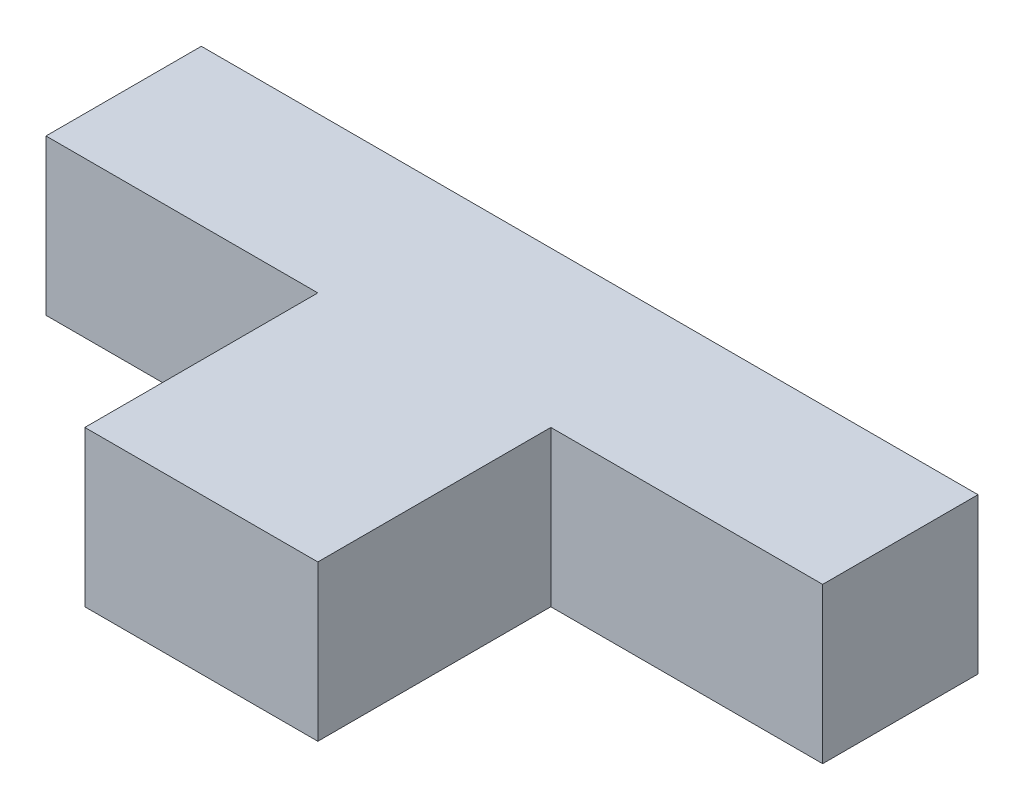
ISO-10303-21;
HEADER;
FILE_DESCRIPTION(('STEP AP214'),'2;1');
FILE_NAME('part.step','',(''),(''),'','','');
FILE_SCHEMA(('AUTOMOTIVE_DESIGN { 1 0 10303 214 1 1 1 1 }'));
ENDSEC;
DATA;
#1=APPLICATION_CONTEXT('core data for automotive mechanical design processes');
#2=APPLICATION_PROTOCOL_DEFINITION('international standard','automotive_design',2000,#1);
#3=PRODUCT_CONTEXT('',#1,'mechanical');
#4=PRODUCT('Part','Part','',(#3));
#5=PRODUCT_RELATED_PRODUCT_CATEGORY('part','',(#4));
#6=PRODUCT_DEFINITION_FORMATION('','',#4);
#7=PRODUCT_DEFINITION_CONTEXT('part definition',#1,'design');
#8=PRODUCT_DEFINITION('design','',#6,#7);
#9=PRODUCT_DEFINITION_SHAPE('','',#8);
#10=(LENGTH_UNIT() NAMED_UNIT(*) SI_UNIT(.MILLI.,.METRE.));
#11=(NAMED_UNIT(*) PLANE_ANGLE_UNIT() SI_UNIT($,.RADIAN.));
#12=(NAMED_UNIT(*) SI_UNIT($,.STERADIAN.) SOLID_ANGLE_UNIT());
#13=UNCERTAINTY_MEASURE_WITH_UNIT(LENGTH_MEASURE(1.E-05),#10,'distance_accuracy_value','');
#14=(GEOMETRIC_REPRESENTATION_CONTEXT(3) GLOBAL_UNCERTAINTY_ASSIGNED_CONTEXT((#13)) GLOBAL_UNIT_ASSIGNED_CONTEXT((#10,
#11,#12)) REPRESENTATION_CONTEXT('',''));
#15=CARTESIAN_POINT('',(0.,0.,0.));
#16=DIRECTION('',(0.,0.,1.));
#17=DIRECTION('',(1.,0.,0.));
#18=AXIS2_PLACEMENT_3D('',#15,#16,#17);
#19=CARTESIAN_POINT('',(0.,50.8,-25.4));
#20=DIRECTION('',(0.,0.,-1.));
#21=DIRECTION('',(-1.,0.,0.));
#22=AXIS2_PLACEMENT_3D('',#19,#20,#21);
#23=PLANE('',#22);
#24=DIRECTION('',(1.,0.,0.));
#25=VECTOR('',#24,1.);
#26=CARTESIAN_POINT('',(0.,0.,-25.4));
#27=LINE('',#26,#25);
#28=CARTESIAN_POINT('',(-127.,0.,-25.4));
#29=VERTEX_POINT('',#28);
#30=CARTESIAN_POINT('',(-38.1,0.,-25.4));
#31=VERTEX_POINT('',#30);
#32=EDGE_CURVE('E129',#29,#31,#27,.T.);
#33=ORIENTED_EDGE('',*,*,#32,.T.);
#34=DIRECTION('',(0.,-1.,0.));
#35=VECTOR('',#34,1.);
#36=CARTESIAN_POINT('',(-38.1,50.8,-25.4));
#37=LINE('',#36,#35);
#38=CARTESIAN_POINT('',(-38.1,50.8,-25.4));
#39=VERTEX_POINT('',#38);
#40=EDGE_CURVE('E11',#39,#31,#37,.T.);
#41=ORIENTED_EDGE('',*,*,#40,.F.);
#42=DIRECTION('',(1.,0.,0.));
#43=VECTOR('',#42,1.);
#44=CARTESIAN_POINT('',(0.,50.8,-25.4));
#45=LINE('',#44,#43);
#46=CARTESIAN_POINT('',(-127.,50.8,-25.4));
#47=VERTEX_POINT('',#46);
#48=EDGE_CURVE('E87',#47,#39,#45,.T.);
#49=ORIENTED_EDGE('',*,*,#48,.F.);
#50=DIRECTION('',(0.,-1.,0.));
#51=VECTOR('',#50,1.);
#52=CARTESIAN_POINT('',(-127.,50.8,-25.4));
#53=LINE('',#52,#51);
#54=EDGE_CURVE('E50',#47,#29,#53,.T.);
#55=ORIENTED_EDGE('',*,*,#54,.T.);
#56=EDGE_LOOP('',(#33,#41,#49,#55));
#57=FACE_BOUND('',#56,.T.);
#58=ADVANCED_FACE('F33',(#57),#23,.F.);
#59=CARTESIAN_POINT('',(-38.1,50.8,0.));
#60=DIRECTION('',(-1.,0.,0.));
#61=DIRECTION('',(0.,0.,1.));
#62=AXIS2_PLACEMENT_3D('',#59,#60,#61);
#63=PLANE('',#62);
#64=DIRECTION('',(0.,0.,-1.));
#65=VECTOR('',#64,1.);
#66=CARTESIAN_POINT('',(-38.1,0.,0.));
#67=LINE('',#66,#65);
#68=CARTESIAN_POINT('',(-38.1,0.,50.8));
#69=VERTEX_POINT('',#68);
#70=EDGE_CURVE('E131',#69,#31,#67,.T.);
#71=ORIENTED_EDGE('',*,*,#70,.F.);
#72=DIRECTION('',(0.,-1.,0.));
#73=VECTOR('',#72,1.);
#74=CARTESIAN_POINT('',(-38.1,50.8,50.8));
#75=LINE('',#74,#73);
#76=CARTESIAN_POINT('',(-38.1,50.8,50.8));
#77=VERTEX_POINT('',#76);
#78=EDGE_CURVE('E42',#77,#69,#75,.T.);
#79=ORIENTED_EDGE('',*,*,#78,.F.);
#80=DIRECTION('',(0.,0.,-1.));
#81=VECTOR('',#80,1.);
#82=CARTESIAN_POINT('',(-38.1,50.8,0.));
#83=LINE('',#82,#81);
#84=EDGE_CURVE('E175',#77,#39,#83,.T.);
#85=ORIENTED_EDGE('',*,*,#84,.T.);
#86=ORIENTED_EDGE('',*,*,#40,.T.);
#87=EDGE_LOOP('',(#71,#79,#85,#86));
#88=FACE_BOUND('',#87,.T.);
#89=ADVANCED_FACE('F35',(#88),#63,.T.);
#90=CARTESIAN_POINT('',(0.,50.8,50.8));
#91=DIRECTION('',(0.,0.,1.));
#92=DIRECTION('',(1.,0.,0.));
#93=AXIS2_PLACEMENT_3D('',#90,#91,#92);
#94=PLANE('',#93);
#95=DIRECTION('',(-1.,0.,0.));
#96=VECTOR('',#95,1.);
#97=CARTESIAN_POINT('',(0.,0.,50.8));
#98=LINE('',#97,#96);
#99=CARTESIAN_POINT('',(38.1,0.,50.8));
#100=VERTEX_POINT('',#99);
#101=EDGE_CURVE('E135',#100,#69,#98,.T.);
#102=ORIENTED_EDGE('',*,*,#101,.F.);
#103=DIRECTION('',(0.,-1.,0.));
#104=VECTOR('',#103,1.);
#105=CARTESIAN_POINT('',(38.1,50.8,50.8));
#106=LINE('',#105,#104);
#107=CARTESIAN_POINT('',(38.1,50.8,50.8));
#108=VERTEX_POINT('',#107);
#109=EDGE_CURVE('E152',#108,#100,#106,.T.);
#110=ORIENTED_EDGE('',*,*,#109,.F.);
#111=DIRECTION('',(-1.,0.,0.));
#112=VECTOR('',#111,1.);
#113=CARTESIAN_POINT('',(0.,50.8,50.8));
#114=LINE('',#113,#112);
#115=EDGE_CURVE('E159',#108,#77,#114,.T.);
#116=ORIENTED_EDGE('',*,*,#115,.T.);
#117=ORIENTED_EDGE('',*,*,#78,.T.);
#118=EDGE_LOOP('',(#102,#110,#116,#117));
#119=FACE_BOUND('',#118,.T.);
#120=ADVANCED_FACE('F157',(#119),#94,.T.);
#121=CARTESIAN_POINT('',(38.1,50.8,0.));
#122=DIRECTION('',(-1.,0.,0.));
#123=DIRECTION('',(0.,0.,1.));
#124=AXIS2_PLACEMENT_3D('',#121,#122,#123);
#125=PLANE('',#124);
#126=DIRECTION('',(0.,0.,-1.));
#127=VECTOR('',#126,1.);
#128=CARTESIAN_POINT('',(38.1,0.,0.));
#129=LINE('',#128,#127);
#130=CARTESIAN_POINT('',(38.1,0.,-25.4));
#131=VERTEX_POINT('',#130);
#132=EDGE_CURVE('E138',#100,#131,#129,.T.);
#133=ORIENTED_EDGE('',*,*,#132,.T.);
#134=DIRECTION('',(0.,-1.,0.));
#135=VECTOR('',#134,1.);
#136=CARTESIAN_POINT('',(38.1,50.8,-25.4));
#137=LINE('',#136,#135);
#138=CARTESIAN_POINT('',(38.1,50.8,-25.4));
#139=VERTEX_POINT('',#138);
#140=EDGE_CURVE('E149',#139,#131,#137,.T.);
#141=ORIENTED_EDGE('',*,*,#140,.F.);
#142=DIRECTION('',(0.,0.,-1.));
#143=VECTOR('',#142,1.);
#144=CARTESIAN_POINT('',(38.1,50.8,0.));
#145=LINE('',#144,#143);
#146=EDGE_CURVE('E172',#108,#139,#145,.T.);
#147=ORIENTED_EDGE('',*,*,#146,.F.);
#148=ORIENTED_EDGE('',*,*,#109,.T.);
#149=EDGE_LOOP('',(#133,#141,#147,#148));
#150=FACE_BOUND('',#149,.T.);
#151=ADVANCED_FACE('F168',(#150),#125,.F.);
#152=CARTESIAN_POINT('',(127.,0.,-25.4));
#153=VERTEX_POINT('',#152);
#154=EDGE_CURVE('E132',#131,#153,#27,.T.);
#155=ORIENTED_EDGE('',*,*,#154,.T.);
#156=DIRECTION('',(0.,-1.,0.));
#157=VECTOR('',#156,1.);
#158=CARTESIAN_POINT('',(127.,50.8,-25.4));
#159=LINE('',#158,#157);
#160=CARTESIAN_POINT('',(127.,50.8,-25.4));
#161=VERTEX_POINT('',#160);
#162=EDGE_CURVE('E121',#161,#153,#159,.T.);
#163=ORIENTED_EDGE('',*,*,#162,.F.);
#164=EDGE_CURVE('E109',#139,#161,#45,.T.);
#165=ORIENTED_EDGE('',*,*,#164,.F.);
#166=ORIENTED_EDGE('',*,*,#140,.T.);
#167=EDGE_LOOP('',(#155,#163,#165,#166));
#168=FACE_BOUND('',#167,.T.);
#169=ADVANCED_FACE('F171',(#168),#23,.F.);
#170=CARTESIAN_POINT('',(127.,50.8,0.));
#171=DIRECTION('',(-1.,0.,0.));
#172=DIRECTION('',(0.,0.,1.));
#173=AXIS2_PLACEMENT_3D('',#170,#171,#172);
#174=PLANE('',#173);
#175=DIRECTION('',(0.,0.,-1.));
#176=VECTOR('',#175,1.);
#177=CARTESIAN_POINT('',(127.,0.,0.));
#178=LINE('',#177,#176);
#179=CARTESIAN_POINT('',(127.,0.,-76.2));
#180=VERTEX_POINT('',#179);
#181=EDGE_CURVE('E118',#153,#180,#178,.T.);
#182=ORIENTED_EDGE('',*,*,#181,.T.);
#183=DIRECTION('',(0.,-1.,0.));
#184=VECTOR('',#183,1.);
#185=CARTESIAN_POINT('',(127.,50.8,-76.2));
#186=LINE('',#185,#184);
#187=CARTESIAN_POINT('',(127.,50.8,-76.2));
#188=VERTEX_POINT('',#187);
#189=EDGE_CURVE('E115',#188,#180,#186,.T.);
#190=ORIENTED_EDGE('',*,*,#189,.F.);
#191=DIRECTION('',(0.,0.,-1.));
#192=VECTOR('',#191,1.);
#193=CARTESIAN_POINT('',(127.,50.8,0.));
#194=LINE('',#193,#192);
#195=EDGE_CURVE('E103',#161,#188,#194,.T.);
#196=ORIENTED_EDGE('',*,*,#195,.F.);
#197=ORIENTED_EDGE('',*,*,#162,.T.);
#198=EDGE_LOOP('',(#182,#190,#196,#197));
#199=FACE_BOUND('',#198,.T.);
#200=ADVANCED_FACE('F116',(#199),#174,.F.);
#201=CARTESIAN_POINT('',(0.,50.8,-76.2));
#202=DIRECTION('',(0.,0.,-1.));
#203=DIRECTION('',(-1.,0.,0.));
#204=AXIS2_PLACEMENT_3D('',#201,#202,#203);
#205=PLANE('',#204);
#206=DIRECTION('',(1.,0.,0.));
#207=VECTOR('',#206,1.);
#208=CARTESIAN_POINT('',(0.,0.,-76.2));
#209=LINE('',#208,#207);
#210=CARTESIAN_POINT('',(-127.,0.,-76.2));
#211=VERTEX_POINT('',#210);
#212=EDGE_CURVE('E141',#211,#180,#209,.T.);
#213=ORIENTED_EDGE('',*,*,#212,.F.);
#214=DIRECTION('',(0.,-1.,0.));
#215=VECTOR('',#214,1.);
#216=CARTESIAN_POINT('',(-127.,50.8,-76.2));
#217=LINE('',#216,#215);
#218=CARTESIAN_POINT('',(-127.,50.8,-76.2));
#219=VERTEX_POINT('',#218);
#220=EDGE_CURVE('E75',#219,#211,#217,.T.);
#221=ORIENTED_EDGE('',*,*,#220,.F.);
#222=DIRECTION('',(1.,0.,0.));
#223=VECTOR('',#222,1.);
#224=CARTESIAN_POINT('',(0.,50.8,-76.2));
#225=LINE('',#224,#223);
#226=EDGE_CURVE('E107',#219,#188,#225,.T.);
#227=ORIENTED_EDGE('',*,*,#226,.T.);
#228=ORIENTED_EDGE('',*,*,#189,.T.);
#229=EDGE_LOOP('',(#213,#221,#227,#228));
#230=FACE_BOUND('',#229,.T.);
#231=ADVANCED_FACE('F123',(#230),#205,.T.);
#232=CARTESIAN_POINT('',(-127.,50.8,0.));
#233=DIRECTION('',(-1.,0.,0.));
#234=DIRECTION('',(0.,0.,1.));
#235=AXIS2_PLACEMENT_3D('',#232,#233,#234);
#236=PLANE('',#235);
#237=DIRECTION('',(0.,0.,-1.));
#238=VECTOR('',#237,1.);
#239=CARTESIAN_POINT('',(-127.,0.,0.));
#240=LINE('',#239,#238);
#241=EDGE_CURVE('E143',#29,#211,#240,.T.);
#242=ORIENTED_EDGE('',*,*,#241,.F.);
#243=ORIENTED_EDGE('',*,*,#54,.F.);
#244=DIRECTION('',(0.,0.,-1.));
#245=VECTOR('',#244,1.);
#246=CARTESIAN_POINT('',(-127.,50.8,0.));
#247=LINE('',#246,#245);
#248=EDGE_CURVE('E124',#47,#219,#247,.T.);
#249=ORIENTED_EDGE('',*,*,#248,.T.);
#250=ORIENTED_EDGE('',*,*,#220,.T.);
#251=EDGE_LOOP('',(#242,#243,#249,#250));
#252=FACE_BOUND('',#251,.T.);
#253=ADVANCED_FACE('F177',(#252),#236,.T.);
#254=CARTESIAN_POINT('',(0.,50.8,0.));
#255=DIRECTION('',(0.,1.,0.));
#256=DIRECTION('',(0.,0.,1.));
#257=AXIS2_PLACEMENT_3D('',#254,#255,#256);
#258=PLANE('',#257);
#259=ORIENTED_EDGE('',*,*,#48,.T.);
#260=ORIENTED_EDGE('',*,*,#84,.F.);
#261=ORIENTED_EDGE('',*,*,#115,.F.);
#262=ORIENTED_EDGE('',*,*,#146,.T.);
#263=ORIENTED_EDGE('',*,*,#164,.T.);
#264=ORIENTED_EDGE('',*,*,#195,.T.);
#265=ORIENTED_EDGE('',*,*,#226,.F.);
#266=ORIENTED_EDGE('',*,*,#248,.F.);
#267=EDGE_LOOP('',(#259,#260,#261,#262,#263,#264,#265,#266));
#268=FACE_BOUND('',#267,.T.);
#269=ADVANCED_FACE('F105',(#268),#258,.T.);
#270=CARTESIAN_POINT('',(0.,0.,0.));
#271=DIRECTION('',(0.,1.,0.));
#272=DIRECTION('',(0.,0.,1.));
#273=AXIS2_PLACEMENT_3D('',#270,#271,#272);
#274=PLANE('',#273);
#275=ORIENTED_EDGE('',*,*,#32,.F.);
#276=ORIENTED_EDGE('',*,*,#241,.T.);
#277=ORIENTED_EDGE('',*,*,#212,.T.);
#278=ORIENTED_EDGE('',*,*,#181,.F.);
#279=ORIENTED_EDGE('',*,*,#154,.F.);
#280=ORIENTED_EDGE('',*,*,#132,.F.);
#281=ORIENTED_EDGE('',*,*,#101,.T.);
#282=ORIENTED_EDGE('',*,*,#70,.T.);
#283=EDGE_LOOP('',(#275,#276,#277,#278,#279,#280,#281,#282));
#284=FACE_BOUND('',#283,.T.);
#285=ADVANCED_FACE('F164',(#284),#274,.F.);
#286=CLOSED_SHELL('',(#58,#89,#120,#151,#169,#200,#231,#253,#269,#285));
#287=MANIFOLD_SOLID_BREP('B2',#286);
#288=ADVANCED_BREP_SHAPE_REPRESENTATION('',(#18,#287),#14);
#289=SHAPE_DEFINITION_REPRESENTATION(#9,#288);
ENDSEC;
END-ISO-10303-21;
